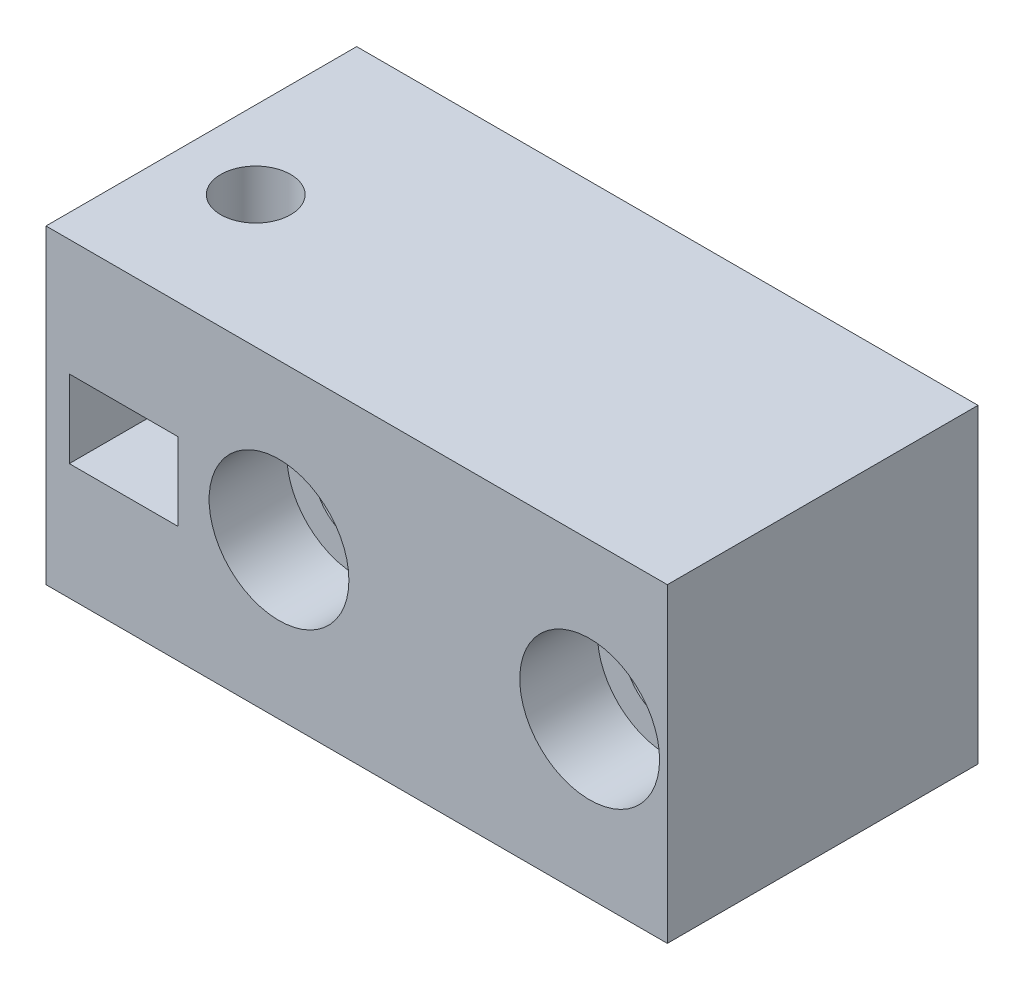
ISO-10303-21;
HEADER;
FILE_DESCRIPTION(('STEP AP214'),'2;1');
FILE_NAME('part.step','',(''),(''),'','','');
FILE_SCHEMA(('AUTOMOTIVE_DESIGN { 1 0 10303 214 1 1 1 1 }'));
ENDSEC;
DATA;
#1=APPLICATION_CONTEXT('core data for automotive mechanical design processes');
#2=APPLICATION_PROTOCOL_DEFINITION('international standard','automotive_design',2000,#1);
#3=PRODUCT_CONTEXT('',#1,'mechanical');
#4=PRODUCT('Part','Part','',(#3));
#5=PRODUCT_RELATED_PRODUCT_CATEGORY('part','',(#4));
#6=PRODUCT_DEFINITION_FORMATION('','',#4);
#7=PRODUCT_DEFINITION_CONTEXT('part definition',#1,'design');
#8=PRODUCT_DEFINITION('design','',#6,#7);
#9=PRODUCT_DEFINITION_SHAPE('','',#8);
#10=(LENGTH_UNIT() NAMED_UNIT(*) SI_UNIT(.MILLI.,.METRE.));
#11=(NAMED_UNIT(*) PLANE_ANGLE_UNIT() SI_UNIT($,.RADIAN.));
#12=(NAMED_UNIT(*) SI_UNIT($,.STERADIAN.) SOLID_ANGLE_UNIT());
#13=UNCERTAINTY_MEASURE_WITH_UNIT(LENGTH_MEASURE(1.E-05),#10,'distance_accuracy_value','');
#14=(GEOMETRIC_REPRESENTATION_CONTEXT(3) GLOBAL_UNCERTAINTY_ASSIGNED_CONTEXT((#13)) GLOBAL_UNIT_ASSIGNED_CONTEXT((#10,
#11,#12)) REPRESENTATION_CONTEXT('',''));
#15=CARTESIAN_POINT('',(0.,0.,0.));
#16=DIRECTION('',(0.,0.,1.));
#17=DIRECTION('',(1.,0.,0.));
#18=AXIS2_PLACEMENT_3D('',#15,#16,#17);
#19=CARTESIAN_POINT('',(45.,10.,0.));
#20=DIRECTION('',(0.,0.,1.));
#21=DIRECTION('',(1.,0.,0.));
#22=AXIS2_PLACEMENT_3D('',#19,#20,#21);
#23=CYLINDRICAL_SURFACE('',#22,2.75);
#24=CARTESIAN_POINT('',(45.,10.,0.));
#25=DIRECTION('',(0.,0.,1.));
#26=DIRECTION('',(1.,0.,0.));
#27=AXIS2_PLACEMENT_3D('',#24,#25,#26);
#28=CIRCLE('',#27,2.75);
#29=CARTESIAN_POINT('',(47.75,10.,0.));
#30=VERTEX_POINT('',#29);
#31=EDGE_CURVE('E212',#30,#30,#28,.T.);
#32=ORIENTED_EDGE('',*,*,#31,.F.);
#33=EDGE_LOOP('',(#32));
#34=FACE_BOUND('',#33,.T.);
#35=CARTESIAN_POINT('',(45.,10.,15.));
#36=DIRECTION('',(0.,0.,1.));
#37=DIRECTION('',(1.,0.,0.));
#38=AXIS2_PLACEMENT_3D('',#35,#36,#37);
#39=CIRCLE('',#38,2.75);
#40=CARTESIAN_POINT('',(47.75,10.,15.));
#41=VERTEX_POINT('',#40);
#42=EDGE_CURVE('E37',#41,#41,#39,.F.);
#43=ORIENTED_EDGE('',*,*,#42,.F.);
#44=EDGE_LOOP('',(#43));
#45=FACE_BOUND('',#44,.T.);
#46=ADVANCED_FACE('F33',(#34,#45),#23,.F.);
#47=CARTESIAN_POINT('',(25.,10.,0.));
#48=DIRECTION('',(0.,0.,1.));
#49=DIRECTION('',(1.,0.,0.));
#50=AXIS2_PLACEMENT_3D('',#47,#48,#49);
#51=CYLINDRICAL_SURFACE('',#50,2.75);
#52=CARTESIAN_POINT('',(25.,10.,0.));
#53=DIRECTION('',(0.,0.,1.));
#54=DIRECTION('',(1.,0.,0.));
#55=AXIS2_PLACEMENT_3D('',#52,#53,#54);
#56=CIRCLE('',#55,2.75);
#57=CARTESIAN_POINT('',(27.75,10.,0.));
#58=VERTEX_POINT('',#57);
#59=EDGE_CURVE('E154',#58,#58,#56,.T.);
#60=ORIENTED_EDGE('',*,*,#59,.F.);
#61=EDGE_LOOP('',(#60));
#62=FACE_BOUND('',#61,.T.);
#63=CARTESIAN_POINT('',(25.,10.,15.));
#64=DIRECTION('',(0.,0.,1.));
#65=DIRECTION('',(1.,0.,0.));
#66=AXIS2_PLACEMENT_3D('',#63,#64,#65);
#67=CIRCLE('',#66,2.75);
#68=CARTESIAN_POINT('',(27.75,10.,15.));
#69=VERTEX_POINT('',#68);
#70=EDGE_CURVE('E161',#69,#69,#67,.F.);
#71=ORIENTED_EDGE('',*,*,#70,.F.);
#72=EDGE_LOOP('',(#71));
#73=FACE_BOUND('',#72,.T.);
#74=ADVANCED_FACE('F269',(#62,#73),#51,.F.);
#75=CARTESIAN_POINT('',(0.,0.,0.));
#76=DIRECTION('',(0.,0.,-1.));
#77=DIRECTION('',(-1.,0.,0.));
#78=AXIS2_PLACEMENT_3D('',#75,#76,#77);
#79=PLANE('',#78);
#80=DIRECTION('',(0.,-1.,0.));
#81=VECTOR('',#80,1.);
#82=CARTESIAN_POINT('',(10.,0.,0.));
#83=LINE('',#82,#81);
#84=CARTESIAN_POINT('',(10.,20.,0.));
#85=VERTEX_POINT('',#84);
#86=CARTESIAN_POINT('',(10.,0.,0.));
#87=VERTEX_POINT('',#86);
#88=EDGE_CURVE('E139',#85,#87,#83,.T.);
#89=ORIENTED_EDGE('',*,*,#88,.F.);
#90=DIRECTION('',(-1.,0.,0.));
#91=VECTOR('',#90,1.);
#92=CARTESIAN_POINT('',(0.,20.,0.));
#93=LINE('',#92,#91);
#94=CARTESIAN_POINT('',(50.,20.,0.));
#95=VERTEX_POINT('',#94);
#96=EDGE_CURVE('E138',#95,#85,#93,.T.);
#97=ORIENTED_EDGE('',*,*,#96,.F.);
#98=DIRECTION('',(0.,1.,0.));
#99=VECTOR('',#98,1.);
#100=CARTESIAN_POINT('',(50.,0.,0.));
#101=LINE('',#100,#99);
#102=CARTESIAN_POINT('',(50.,0.,0.));
#103=VERTEX_POINT('',#102);
#104=EDGE_CURVE('E153',#103,#95,#101,.T.);
#105=ORIENTED_EDGE('',*,*,#104,.F.);
#106=DIRECTION('',(1.,0.,0.));
#107=VECTOR('',#106,1.);
#108=CARTESIAN_POINT('',(0.,0.,0.));
#109=LINE('',#108,#107);
#110=EDGE_CURVE('E151',#87,#103,#109,.T.);
#111=ORIENTED_EDGE('',*,*,#110,.F.);
#112=EDGE_LOOP('',(#89,#97,#105,#111));
#113=FACE_BOUND('',#112,.T.);
#114=ORIENTED_EDGE('',*,*,#31,.T.);
#115=EDGE_LOOP('',(#114));
#116=FACE_BOUND('',#115,.T.);
#117=DIRECTION('',(0.,-1.,0.));
#118=VECTOR('',#117,1.);
#119=CARTESIAN_POINT('',(11.5,7.5,0.));
#120=LINE('',#119,#118);
#121=CARTESIAN_POINT('',(11.5,12.5,0.));
#122=VERTEX_POINT('',#121);
#123=CARTESIAN_POINT('',(11.5,7.5,0.));
#124=VERTEX_POINT('',#123);
#125=EDGE_CURVE('E216',#122,#124,#120,.T.);
#126=ORIENTED_EDGE('',*,*,#125,.T.);
#127=DIRECTION('',(1.,0.,0.));
#128=VECTOR('',#127,1.);
#129=CARTESIAN_POINT('',(11.5,7.5,0.));
#130=LINE('',#129,#128);
#131=CARTESIAN_POINT('',(18.5,7.5,0.));
#132=VERTEX_POINT('',#131);
#133=EDGE_CURVE('E219',#124,#132,#130,.T.);
#134=ORIENTED_EDGE('',*,*,#133,.T.);
#135=DIRECTION('',(0.,1.,0.));
#136=VECTOR('',#135,1.);
#137=CARTESIAN_POINT('',(18.5,7.5,0.));
#138=LINE('',#137,#136);
#139=CARTESIAN_POINT('',(18.5,12.5,0.));
#140=VERTEX_POINT('',#139);
#141=EDGE_CURVE('E223',#132,#140,#138,.T.);
#142=ORIENTED_EDGE('',*,*,#141,.T.);
#143=DIRECTION('',(-1.,0.,0.));
#144=VECTOR('',#143,1.);
#145=CARTESIAN_POINT('',(11.5,12.5,0.));
#146=LINE('',#145,#144);
#147=EDGE_CURVE('E226',#140,#122,#146,.T.);
#148=ORIENTED_EDGE('',*,*,#147,.T.);
#149=EDGE_LOOP('',(#126,#134,#142,#148));
#150=FACE_BOUND('',#149,.T.);
#151=ORIENTED_EDGE('',*,*,#59,.T.);
#152=EDGE_LOOP('',(#151));
#153=FACE_BOUND('',#152,.T.);
#154=DIRECTION('',(-1.,0.,0.));
#155=VECTOR('',#154,1.);
#156=CARTESIAN_POINT('',(39.,7.,0.));
#157=LINE('',#156,#155);
#158=CARTESIAN_POINT('',(39.,7.,0.));
#159=VERTEX_POINT('',#158);
#160=CARTESIAN_POINT('',(31.,7.,0.));
#161=VERTEX_POINT('',#160);
#162=EDGE_CURVE('E168',#159,#161,#157,.T.);
#163=ORIENTED_EDGE('',*,*,#162,.F.);
#164=DIRECTION('',(0.,-1.,0.));
#165=VECTOR('',#164,1.);
#166=CARTESIAN_POINT('',(39.,7.,0.));
#167=LINE('',#166,#165);
#168=CARTESIAN_POINT('',(39.,13.,0.));
#169=VERTEX_POINT('',#168);
#170=EDGE_CURVE('E163',#169,#159,#167,.T.);
#171=ORIENTED_EDGE('',*,*,#170,.F.);
#172=DIRECTION('',(1.,0.,0.));
#173=VECTOR('',#172,1.);
#174=CARTESIAN_POINT('',(39.,13.,0.));
#175=LINE('',#174,#173);
#176=CARTESIAN_POINT('',(31.,13.,0.));
#177=VERTEX_POINT('',#176);
#178=EDGE_CURVE('E185',#177,#169,#175,.T.);
#179=ORIENTED_EDGE('',*,*,#178,.F.);
#180=DIRECTION('',(0.,1.,0.));
#181=VECTOR('',#180,1.);
#182=CARTESIAN_POINT('',(31.,7.,0.));
#183=LINE('',#182,#181);
#184=EDGE_CURVE('E193',#161,#177,#183,.T.);
#185=ORIENTED_EDGE('',*,*,#184,.F.);
#186=EDGE_LOOP('',(#163,#171,#179,#185));
#187=FACE_BOUND('',#186,.T.);
#188=ADVANCED_FACE('F254',(#113,#116,#150,#153,#187),#79,.T.);
#189=CARTESIAN_POINT('',(0.,0.,20.));
#190=DIRECTION('',(0.,1.,0.));
#191=DIRECTION('',(0.,0.,1.));
#192=AXIS2_PLACEMENT_3D('',#189,#190,#191);
#193=PLANE('',#192);
#194=CARTESIAN_POINT('',(15.,0.,11.5));
#195=DIRECTION('',(0.,1.,0.));
#196=DIRECTION('',(0.,0.,1.));
#197=AXIS2_PLACEMENT_3D('',#194,#195,#196);
#198=CIRCLE('',#197,2.25);
#199=CARTESIAN_POINT('',(15.,0.,13.75));
#200=VERTEX_POINT('',#199);
#201=EDGE_CURVE('E160',#200,#200,#198,.T.);
#202=ORIENTED_EDGE('',*,*,#201,.T.);
#203=EDGE_LOOP('',(#202));
#204=FACE_BOUND('',#203,.T.);
#205=DIRECTION('',(1.,0.,0.));
#206=VECTOR('',#205,1.);
#207=CARTESIAN_POINT('',(0.,0.,20.));
#208=LINE('',#207,#206);
#209=CARTESIAN_POINT('',(10.,0.,20.));
#210=VERTEX_POINT('',#209);
#211=CARTESIAN_POINT('',(50.,0.,20.));
#212=VERTEX_POINT('',#211);
#213=EDGE_CURVE('E147',#210,#212,#208,.T.);
#214=ORIENTED_EDGE('',*,*,#213,.F.);
#215=DIRECTION('',(0.,0.,1.));
#216=VECTOR('',#215,1.);
#217=CARTESIAN_POINT('',(10.,0.,-3.));
#218=LINE('',#217,#216);
#219=EDGE_CURVE('E50',#87,#210,#218,.T.);
#220=ORIENTED_EDGE('',*,*,#219,.F.);
#221=ORIENTED_EDGE('',*,*,#110,.T.);
#222=DIRECTION('',(0.,0.,-1.));
#223=VECTOR('',#222,1.);
#224=CARTESIAN_POINT('',(50.,0.,20.));
#225=LINE('',#224,#223);
#226=EDGE_CURVE('E11',#212,#103,#225,.T.);
#227=ORIENTED_EDGE('',*,*,#226,.F.);
#228=EDGE_LOOP('',(#214,#220,#221,#227));
#229=FACE_BOUND('',#228,.T.);
#230=ADVANCED_FACE('F35',(#204,#229),#193,.F.);
#231=CARTESIAN_POINT('',(50.,0.,20.));
#232=DIRECTION('',(-1.,0.,0.));
#233=DIRECTION('',(0.,0.,1.));
#234=AXIS2_PLACEMENT_3D('',#231,#232,#233);
#235=PLANE('',#234);
#236=ORIENTED_EDGE('',*,*,#104,.T.);
#237=DIRECTION('',(0.,0.,-1.));
#238=VECTOR('',#237,1.);
#239=CARTESIAN_POINT('',(50.,20.,20.));
#240=LINE('',#239,#238);
#241=CARTESIAN_POINT('',(50.,20.,20.));
#242=VERTEX_POINT('',#241);
#243=EDGE_CURVE('E42',#242,#95,#240,.T.);
#244=ORIENTED_EDGE('',*,*,#243,.F.);
#245=DIRECTION('',(0.,1.,0.));
#246=VECTOR('',#245,1.);
#247=CARTESIAN_POINT('',(50.,0.,20.));
#248=LINE('',#247,#246);
#249=EDGE_CURVE('E143',#212,#242,#248,.T.);
#250=ORIENTED_EDGE('',*,*,#249,.F.);
#251=ORIENTED_EDGE('',*,*,#226,.T.);
#252=EDGE_LOOP('',(#236,#244,#250,#251));
#253=FACE_BOUND('',#252,.T.);
#254=ADVANCED_FACE('F252',(#253),#235,.F.);
#255=CARTESIAN_POINT('',(0.,20.,20.));
#256=DIRECTION('',(0.,-1.,0.));
#257=DIRECTION('',(0.,0.,-1.));
#258=AXIS2_PLACEMENT_3D('',#255,#256,#257);
#259=PLANE('',#258);
#260=CARTESIAN_POINT('',(15.,20.,11.5));
#261=DIRECTION('',(0.,1.,0.));
#262=DIRECTION('',(0.,0.,1.));
#263=AXIS2_PLACEMENT_3D('',#260,#261,#262);
#264=CIRCLE('',#263,2.25);
#265=CARTESIAN_POINT('',(15.,20.,13.75));
#266=VERTEX_POINT('',#265);
#267=EDGE_CURVE('E204',#266,#266,#264,.T.);
#268=ORIENTED_EDGE('',*,*,#267,.F.);
#269=EDGE_LOOP('',(#268));
#270=FACE_BOUND('',#269,.T.);
#271=ORIENTED_EDGE('',*,*,#96,.T.);
#272=DIRECTION('',(0.,0.,1.));
#273=VECTOR('',#272,1.);
#274=CARTESIAN_POINT('',(10.,20.,-3.));
#275=LINE('',#274,#273);
#276=CARTESIAN_POINT('',(10.,20.,20.));
#277=VERTEX_POINT('',#276);
#278=EDGE_CURVE('E125',#85,#277,#275,.T.);
#279=ORIENTED_EDGE('',*,*,#278,.T.);
#280=DIRECTION('',(-1.,0.,0.));
#281=VECTOR('',#280,1.);
#282=CARTESIAN_POINT('',(0.,20.,20.));
#283=LINE('',#282,#281);
#284=EDGE_CURVE('E136',#242,#277,#283,.T.);
#285=ORIENTED_EDGE('',*,*,#284,.F.);
#286=ORIENTED_EDGE('',*,*,#243,.T.);
#287=EDGE_LOOP('',(#271,#279,#285,#286));
#288=FACE_BOUND('',#287,.T.);
#289=ADVANCED_FACE('F134',(#270,#288),#259,.F.);
#290=CARTESIAN_POINT('',(0.,0.,20.));
#291=DIRECTION('',(0.,0.,-1.));
#292=DIRECTION('',(-1.,0.,0.));
#293=AXIS2_PLACEMENT_3D('',#290,#291,#292);
#294=PLANE('',#293);
#295=CARTESIAN_POINT('',(45.,10.,20.));
#296=DIRECTION('',(0.,0.,1.));
#297=DIRECTION('',(1.,0.,0.));
#298=AXIS2_PLACEMENT_3D('',#295,#296,#297);
#299=CIRCLE('',#298,4.5);
#300=CARTESIAN_POINT('',(49.5,10.,20.));
#301=VERTEX_POINT('',#300);
#302=EDGE_CURVE('E178',#301,#301,#299,.T.);
#303=ORIENTED_EDGE('',*,*,#302,.F.);
#304=EDGE_LOOP('',(#303));
#305=FACE_BOUND('',#304,.T.);
#306=CARTESIAN_POINT('',(25.,10.,20.));
#307=DIRECTION('',(0.,0.,1.));
#308=DIRECTION('',(1.,0.,0.));
#309=AXIS2_PLACEMENT_3D('',#306,#307,#308);
#310=CIRCLE('',#309,4.5);
#311=CARTESIAN_POINT('',(29.5,10.,20.));
#312=VERTEX_POINT('',#311);
#313=EDGE_CURVE('E171',#312,#312,#310,.T.);
#314=ORIENTED_EDGE('',*,*,#313,.F.);
#315=EDGE_LOOP('',(#314));
#316=FACE_BOUND('',#315,.T.);
#317=DIRECTION('',(1.,0.,0.));
#318=VECTOR('',#317,1.);
#319=CARTESIAN_POINT('',(11.5,7.5,20.));
#320=LINE('',#319,#318);
#321=CARTESIAN_POINT('',(11.5,7.5,20.));
#322=VERTEX_POINT('',#321);
#323=CARTESIAN_POINT('',(18.5,7.5,20.));
#324=VERTEX_POINT('',#323);
#325=EDGE_CURVE('E231',#322,#324,#320,.T.);
#326=ORIENTED_EDGE('',*,*,#325,.F.);
#327=DIRECTION('',(0.,-1.,0.));
#328=VECTOR('',#327,1.);
#329=CARTESIAN_POINT('',(11.5,7.5,20.));
#330=LINE('',#329,#328);
#331=CARTESIAN_POINT('',(11.5,12.5,20.));
#332=VERTEX_POINT('',#331);
#333=EDGE_CURVE('E211',#332,#322,#330,.T.);
#334=ORIENTED_EDGE('',*,*,#333,.F.);
#335=DIRECTION('',(-1.,0.,0.));
#336=VECTOR('',#335,1.);
#337=CARTESIAN_POINT('',(11.5,12.5,20.));
#338=LINE('',#337,#336);
#339=CARTESIAN_POINT('',(18.5,12.5,20.));
#340=VERTEX_POINT('',#339);
#341=EDGE_CURVE('E220',#340,#332,#338,.T.);
#342=ORIENTED_EDGE('',*,*,#341,.F.);
#343=DIRECTION('',(0.,1.,0.));
#344=VECTOR('',#343,1.);
#345=CARTESIAN_POINT('',(18.5,7.5,20.));
#346=LINE('',#345,#344);
#347=EDGE_CURVE('E234',#324,#340,#346,.T.);
#348=ORIENTED_EDGE('',*,*,#347,.F.);
#349=EDGE_LOOP('',(#326,#334,#342,#348));
#350=FACE_BOUND('',#349,.T.);
#351=ORIENTED_EDGE('',*,*,#284,.T.);
#352=DIRECTION('',(0.,1.,0.));
#353=VECTOR('',#352,1.);
#354=CARTESIAN_POINT('',(10.,20.,20.));
#355=LINE('',#354,#353);
#356=EDGE_CURVE('E122',#210,#277,#355,.T.);
#357=ORIENTED_EDGE('',*,*,#356,.F.);
#358=ORIENTED_EDGE('',*,*,#213,.T.);
#359=ORIENTED_EDGE('',*,*,#249,.T.);
#360=EDGE_LOOP('',(#351,#357,#358,#359));
#361=FACE_BOUND('',#360,.T.);
#362=ADVANCED_FACE('F141',(#305,#316,#350,#361),#294,.F.);
#363=CARTESIAN_POINT('',(11.5,7.5,0.));
#364=DIRECTION('',(-1.,0.,0.));
#365=DIRECTION('',(0.,0.,1.));
#366=AXIS2_PLACEMENT_3D('',#363,#364,#365);
#367=PLANE('',#366);
#368=ORIENTED_EDGE('',*,*,#333,.T.);
#369=DIRECTION('',(0.,0.,1.));
#370=VECTOR('',#369,1.);
#371=CARTESIAN_POINT('',(11.5,7.5,0.));
#372=LINE('',#371,#370);
#373=EDGE_CURVE('E229',#124,#322,#372,.T.);
#374=ORIENTED_EDGE('',*,*,#373,.F.);
#375=ORIENTED_EDGE('',*,*,#125,.F.);
#376=DIRECTION('',(0.,0.,1.));
#377=VECTOR('',#376,1.);
#378=CARTESIAN_POINT('',(11.5,12.5,0.));
#379=LINE('',#378,#377);
#380=EDGE_CURVE('E215',#122,#332,#379,.T.);
#381=ORIENTED_EDGE('',*,*,#380,.T.);
#382=EDGE_LOOP('',(#368,#374,#375,#381));
#383=FACE_BOUND('',#382,.T.);
#384=ADVANCED_FACE('F286',(#383),#367,.F.);
#385=CARTESIAN_POINT('',(11.5,12.5,0.));
#386=DIRECTION('',(0.,1.,0.));
#387=DIRECTION('',(0.,0.,1.));
#388=AXIS2_PLACEMENT_3D('',#385,#386,#387);
#389=PLANE('',#388);
#390=CARTESIAN_POINT('',(15.,12.5,11.5));
#391=DIRECTION('',(0.,1.,0.));
#392=DIRECTION('',(0.,0.,1.));
#393=AXIS2_PLACEMENT_3D('',#390,#391,#392);
#394=CIRCLE('',#393,2.25);
#395=CARTESIAN_POINT('',(15.,12.5,13.75));
#396=VERTEX_POINT('',#395);
#397=EDGE_CURVE('E159',#396,#396,#394,.T.);
#398=ORIENTED_EDGE('',*,*,#397,.T.);
#399=EDGE_LOOP('',(#398));
#400=FACE_BOUND('',#399,.T.);
#401=ORIENTED_EDGE('',*,*,#341,.T.);
#402=ORIENTED_EDGE('',*,*,#380,.F.);
#403=ORIENTED_EDGE('',*,*,#147,.F.);
#404=DIRECTION('',(0.,0.,1.));
#405=VECTOR('',#404,1.);
#406=CARTESIAN_POINT('',(18.5,12.5,0.));
#407=LINE('',#406,#405);
#408=EDGE_CURVE('E240',#140,#340,#407,.T.);
#409=ORIENTED_EDGE('',*,*,#408,.T.);
#410=EDGE_LOOP('',(#401,#402,#403,#409));
#411=FACE_BOUND('',#410,.T.);
#412=ADVANCED_FACE('F282',(#400,#411),#389,.F.);
#413=CARTESIAN_POINT('',(18.5,7.5,0.));
#414=DIRECTION('',(1.,0.,0.));
#415=DIRECTION('',(0.,0.,-1.));
#416=AXIS2_PLACEMENT_3D('',#413,#414,#415);
#417=PLANE('',#416);
#418=ORIENTED_EDGE('',*,*,#347,.T.);
#419=ORIENTED_EDGE('',*,*,#408,.F.);
#420=ORIENTED_EDGE('',*,*,#141,.F.);
#421=DIRECTION('',(0.,0.,1.));
#422=VECTOR('',#421,1.);
#423=CARTESIAN_POINT('',(18.5,7.5,0.));
#424=LINE('',#423,#422);
#425=EDGE_CURVE('E242',#132,#324,#424,.T.);
#426=ORIENTED_EDGE('',*,*,#425,.T.);
#427=EDGE_LOOP('',(#418,#419,#420,#426));
#428=FACE_BOUND('',#427,.T.);
#429=ADVANCED_FACE('F285',(#428),#417,.F.);
#430=CARTESIAN_POINT('',(11.5,7.5,0.));
#431=DIRECTION('',(0.,-1.,0.));
#432=DIRECTION('',(0.,0.,-1.));
#433=AXIS2_PLACEMENT_3D('',#430,#431,#432);
#434=PLANE('',#433);
#435=CARTESIAN_POINT('',(15.,7.5,11.5));
#436=DIRECTION('',(0.,-1.,0.));
#437=DIRECTION('',(0.,0.,-1.));
#438=AXIS2_PLACEMENT_3D('',#435,#436,#437);
#439=CIRCLE('',#438,2.25);
#440=CARTESIAN_POINT('',(15.,7.5,9.25));
#441=VERTEX_POINT('',#440);
#442=EDGE_CURVE('E157',#441,#441,#439,.T.);
#443=ORIENTED_EDGE('',*,*,#442,.T.);
#444=EDGE_LOOP('',(#443));
#445=FACE_BOUND('',#444,.T.);
#446=ORIENTED_EDGE('',*,*,#325,.T.);
#447=ORIENTED_EDGE('',*,*,#425,.F.);
#448=ORIENTED_EDGE('',*,*,#133,.F.);
#449=ORIENTED_EDGE('',*,*,#373,.T.);
#450=EDGE_LOOP('',(#446,#447,#448,#449));
#451=FACE_BOUND('',#450,.T.);
#452=ADVANCED_FACE('F290',(#445,#451),#434,.F.);
#453=CARTESIAN_POINT('',(15.,0.,11.5));
#454=DIRECTION('',(0.,1.,0.));
#455=DIRECTION('',(0.,0.,1.));
#456=AXIS2_PLACEMENT_3D('',#453,#454,#455);
#457=CYLINDRICAL_SURFACE('',#456,2.25);
#458=ORIENTED_EDGE('',*,*,#201,.F.);
#459=EDGE_LOOP('',(#458));
#460=FACE_BOUND('',#459,.T.);
#461=ORIENTED_EDGE('',*,*,#442,.F.);
#462=EDGE_LOOP('',(#461));
#463=FACE_BOUND('',#462,.T.);
#464=ADVANCED_FACE('F294',(#460,#463),#457,.F.);
#465=ORIENTED_EDGE('',*,*,#267,.T.);
#466=EDGE_LOOP('',(#465));
#467=FACE_BOUND('',#466,.T.);
#468=ORIENTED_EDGE('',*,*,#397,.F.);
#469=EDGE_LOOP('',(#468));
#470=FACE_BOUND('',#469,.T.);
#471=ADVANCED_FACE('F280',(#467,#470),#457,.F.);
#472=CARTESIAN_POINT('',(39.,7.,-3.));
#473=DIRECTION('',(-1.,0.,0.));
#474=DIRECTION('',(0.,0.,1.));
#475=AXIS2_PLACEMENT_3D('',#472,#473,#474);
#476=PLANE('',#475);
#477=ORIENTED_EDGE('',*,*,#170,.T.);
#478=DIRECTION('',(0.,0.,1.));
#479=VECTOR('',#478,1.);
#480=CARTESIAN_POINT('',(39.,7.,-3.));
#481=LINE('',#480,#479);
#482=CARTESIAN_POINT('',(39.,7.,-3.));
#483=VERTEX_POINT('',#482);
#484=EDGE_CURVE('E202',#483,#159,#481,.T.);
#485=ORIENTED_EDGE('',*,*,#484,.F.);
#486=DIRECTION('',(0.,-1.,0.));
#487=VECTOR('',#486,1.);
#488=CARTESIAN_POINT('',(39.,7.,-3.));
#489=LINE('',#488,#487);
#490=CARTESIAN_POINT('',(39.,13.,-3.));
#491=VERTEX_POINT('',#490);
#492=EDGE_CURVE('E181',#491,#483,#489,.T.);
#493=ORIENTED_EDGE('',*,*,#492,.F.);
#494=DIRECTION('',(0.,0.,1.));
#495=VECTOR('',#494,1.);
#496=CARTESIAN_POINT('',(39.,13.,-3.));
#497=LINE('',#496,#495);
#498=EDGE_CURVE('E190',#491,#169,#497,.T.);
#499=ORIENTED_EDGE('',*,*,#498,.T.);
#500=EDGE_LOOP('',(#477,#485,#493,#499));
#501=FACE_BOUND('',#500,.T.);
#502=ADVANCED_FACE('F349',(#501),#476,.F.);
#503=CARTESIAN_POINT('',(39.,7.,-3.));
#504=DIRECTION('',(0.,1.,0.));
#505=DIRECTION('',(0.,0.,1.));
#506=AXIS2_PLACEMENT_3D('',#503,#504,#505);
#507=PLANE('',#506);
#508=ORIENTED_EDGE('',*,*,#162,.T.);
#509=DIRECTION('',(0.,0.,1.));
#510=VECTOR('',#509,1.);
#511=CARTESIAN_POINT('',(31.,7.,-3.));
#512=LINE('',#511,#510);
#513=CARTESIAN_POINT('',(31.,7.,-3.));
#514=VERTEX_POINT('',#513);
#515=EDGE_CURVE('E199',#514,#161,#512,.T.);
#516=ORIENTED_EDGE('',*,*,#515,.F.);
#517=DIRECTION('',(-1.,0.,0.));
#518=VECTOR('',#517,1.);
#519=CARTESIAN_POINT('',(39.,7.,-3.));
#520=LINE('',#519,#518);
#521=EDGE_CURVE('E184',#483,#514,#520,.T.);
#522=ORIENTED_EDGE('',*,*,#521,.F.);
#523=ORIENTED_EDGE('',*,*,#484,.T.);
#524=EDGE_LOOP('',(#508,#516,#522,#523));
#525=FACE_BOUND('',#524,.T.);
#526=ADVANCED_FACE('F339',(#525),#507,.F.);
#527=CARTESIAN_POINT('',(31.,7.,-3.));
#528=DIRECTION('',(1.,0.,0.));
#529=DIRECTION('',(0.,0.,-1.));
#530=AXIS2_PLACEMENT_3D('',#527,#528,#529);
#531=PLANE('',#530);
#532=ORIENTED_EDGE('',*,*,#184,.T.);
#533=DIRECTION('',(0.,0.,1.));
#534=VECTOR('',#533,1.);
#535=CARTESIAN_POINT('',(31.,13.,-3.));
#536=LINE('',#535,#534);
#537=CARTESIAN_POINT('',(31.,13.,-3.));
#538=VERTEX_POINT('',#537);
#539=EDGE_CURVE('E58',#538,#177,#536,.T.);
#540=ORIENTED_EDGE('',*,*,#539,.F.);
#541=DIRECTION('',(0.,1.,0.));
#542=VECTOR('',#541,1.);
#543=CARTESIAN_POINT('',(31.,7.,-3.));
#544=LINE('',#543,#542);
#545=EDGE_CURVE('E187',#514,#538,#544,.T.);
#546=ORIENTED_EDGE('',*,*,#545,.F.);
#547=ORIENTED_EDGE('',*,*,#515,.T.);
#548=EDGE_LOOP('',(#532,#540,#546,#547));
#549=FACE_BOUND('',#548,.T.);
#550=ADVANCED_FACE('F343',(#549),#531,.F.);
#551=CARTESIAN_POINT('',(39.,13.,-3.));
#552=DIRECTION('',(0.,-1.,0.));
#553=DIRECTION('',(0.,0.,-1.));
#554=AXIS2_PLACEMENT_3D('',#551,#552,#553);
#555=PLANE('',#554);
#556=ORIENTED_EDGE('',*,*,#178,.T.);
#557=ORIENTED_EDGE('',*,*,#498,.F.);
#558=DIRECTION('',(1.,0.,0.));
#559=VECTOR('',#558,1.);
#560=CARTESIAN_POINT('',(39.,13.,-3.));
#561=LINE('',#560,#559);
#562=EDGE_CURVE('E189',#538,#491,#561,.T.);
#563=ORIENTED_EDGE('',*,*,#562,.F.);
#564=ORIENTED_EDGE('',*,*,#539,.T.);
#565=EDGE_LOOP('',(#556,#557,#563,#564));
#566=FACE_BOUND('',#565,.T.);
#567=ADVANCED_FACE('F350',(#566),#555,.F.);
#568=CARTESIAN_POINT('',(0.,0.,-3.));
#569=DIRECTION('',(0.,0.,1.));
#570=DIRECTION('',(1.,0.,0.));
#571=AXIS2_PLACEMENT_3D('',#568,#569,#570);
#572=PLANE('',#571);
#573=ORIENTED_EDGE('',*,*,#492,.T.);
#574=ORIENTED_EDGE('',*,*,#521,.T.);
#575=ORIENTED_EDGE('',*,*,#545,.T.);
#576=ORIENTED_EDGE('',*,*,#562,.T.);
#577=EDGE_LOOP('',(#573,#574,#575,#576));
#578=FACE_BOUND('',#577,.T.);
#579=ADVANCED_FACE('F345',(#578),#572,.F.);
#580=CARTESIAN_POINT('',(25.,10.,15.));
#581=DIRECTION('',(0.,0.,1.));
#582=DIRECTION('',(1.,0.,0.));
#583=AXIS2_PLACEMENT_3D('',#580,#581,#582);
#584=PLANE('',#583);
#585=CARTESIAN_POINT('',(25.,10.,15.));
#586=DIRECTION('',(0.,0.,1.));
#587=DIRECTION('',(1.,0.,0.));
#588=AXIS2_PLACEMENT_3D('',#585,#586,#587);
#589=CIRCLE('',#588,4.5);
#590=CARTESIAN_POINT('',(29.5,10.,15.));
#591=VERTEX_POINT('',#590);
#592=EDGE_CURVE('E164',#591,#591,#589,.T.);
#593=ORIENTED_EDGE('',*,*,#592,.T.);
#594=EDGE_LOOP('',(#593));
#595=FACE_BOUND('',#594,.T.);
#596=ORIENTED_EDGE('',*,*,#70,.T.);
#597=EDGE_LOOP('',(#596));
#598=FACE_BOUND('',#597,.T.);
#599=ADVANCED_FACE('F357',(#595,#598),#584,.T.);
#600=CARTESIAN_POINT('',(25.,10.,15.));
#601=DIRECTION('',(0.,0.,1.));
#602=DIRECTION('',(1.,0.,0.));
#603=AXIS2_PLACEMENT_3D('',#600,#601,#602);
#604=CYLINDRICAL_SURFACE('',#603,4.5);
#605=ORIENTED_EDGE('',*,*,#592,.F.);
#606=EDGE_LOOP('',(#605));
#607=FACE_BOUND('',#606,.T.);
#608=ORIENTED_EDGE('',*,*,#313,.T.);
#609=EDGE_LOOP('',(#608));
#610=FACE_BOUND('',#609,.T.);
#611=ADVANCED_FACE('F435',(#607,#610),#604,.F.);
#612=CARTESIAN_POINT('',(45.,10.,15.));
#613=DIRECTION('',(0.,0.,1.));
#614=DIRECTION('',(1.,0.,0.));
#615=AXIS2_PLACEMENT_3D('',#612,#613,#614);
#616=PLANE('',#615);
#617=CARTESIAN_POINT('',(45.,10.,15.));
#618=DIRECTION('',(0.,0.,1.));
#619=DIRECTION('',(1.,0.,0.));
#620=AXIS2_PLACEMENT_3D('',#617,#618,#619);
#621=CIRCLE('',#620,4.5);
#622=CARTESIAN_POINT('',(49.5,10.,15.));
#623=VERTEX_POINT('',#622);
#624=EDGE_CURVE('E258',#623,#623,#621,.T.);
#625=ORIENTED_EDGE('',*,*,#624,.T.);
#626=EDGE_LOOP('',(#625));
#627=FACE_BOUND('',#626,.T.);
#628=ORIENTED_EDGE('',*,*,#42,.T.);
#629=EDGE_LOOP('',(#628));
#630=FACE_BOUND('',#629,.T.);
#631=ADVANCED_FACE('F266',(#627,#630),#616,.T.);
#632=CARTESIAN_POINT('',(45.,10.,15.));
#633=DIRECTION('',(0.,0.,1.));
#634=DIRECTION('',(1.,0.,0.));
#635=AXIS2_PLACEMENT_3D('',#632,#633,#634);
#636=CYLINDRICAL_SURFACE('',#635,4.5);
#637=ORIENTED_EDGE('',*,*,#624,.F.);
#638=EDGE_LOOP('',(#637));
#639=FACE_BOUND('',#638,.T.);
#640=ORIENTED_EDGE('',*,*,#302,.T.);
#641=EDGE_LOOP('',(#640));
#642=FACE_BOUND('',#641,.T.);
#643=ADVANCED_FACE('F419',(#639,#642),#636,.F.);
#644=CARTESIAN_POINT('',(10.,20.,-3.));
#645=DIRECTION('',(1.,0.,0.));
#646=DIRECTION('',(0.,1.,0.));
#647=AXIS2_PLACEMENT_3D('',#644,#645,#646);
#648=PLANE('',#647);
#649=ORIENTED_EDGE('',*,*,#88,.T.);
#650=ORIENTED_EDGE('',*,*,#219,.T.);
#651=ORIENTED_EDGE('',*,*,#356,.T.);
#652=ORIENTED_EDGE('',*,*,#278,.F.);
#653=EDGE_LOOP('',(#649,#650,#651,#652));
#654=FACE_BOUND('',#653,.T.);
#655=ADVANCED_FACE('F124',(#654),#648,.F.);
#656=CLOSED_SHELL('',(#46,#74,#188,#230,#254,#289,#362,#384,#412,#429,#452,#464,#471,#502,#526,
#550,#567,#579,#599,#611,#631,#643,#655));
#657=MANIFOLD_SOLID_BREP('B2',#656);
#658=ADVANCED_BREP_SHAPE_REPRESENTATION('',(#18,#657),#14);
#659=SHAPE_DEFINITION_REPRESENTATION(#9,#658);
ENDSEC;
END-ISO-10303-21;
